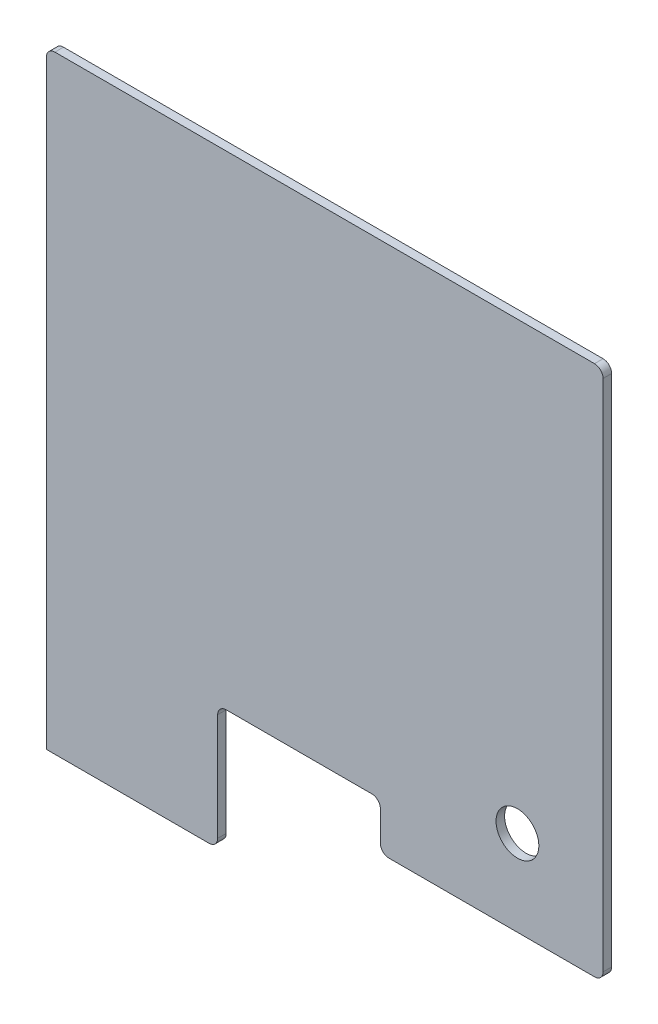
ISO-10303-21;
HEADER;
FILE_DESCRIPTION(('STEP AP214'),'2;1');
FILE_NAME('part.step','',(''),(''),'','','');
FILE_SCHEMA(('AUTOMOTIVE_DESIGN { 1 0 10303 214 1 1 1 1 }'));
ENDSEC;
DATA;
#1=APPLICATION_CONTEXT('core data for automotive mechanical design processes');
#2=APPLICATION_PROTOCOL_DEFINITION('international standard','automotive_design',2000,#1);
#3=PRODUCT_CONTEXT('',#1,'mechanical');
#4=PRODUCT('Part','Part','',(#3));
#5=PRODUCT_RELATED_PRODUCT_CATEGORY('part','',(#4));
#6=PRODUCT_DEFINITION_FORMATION('','',#4);
#7=PRODUCT_DEFINITION_CONTEXT('part definition',#1,'design');
#8=PRODUCT_DEFINITION('design','',#6,#7);
#9=PRODUCT_DEFINITION_SHAPE('','',#8);
#10=(LENGTH_UNIT() NAMED_UNIT(*) SI_UNIT(.MILLI.,.METRE.));
#11=(NAMED_UNIT(*) PLANE_ANGLE_UNIT() SI_UNIT($,.RADIAN.));
#12=(NAMED_UNIT(*) SI_UNIT($,.STERADIAN.) SOLID_ANGLE_UNIT());
#13=UNCERTAINTY_MEASURE_WITH_UNIT(LENGTH_MEASURE(1.E-05),#10,'distance_accuracy_value','');
#14=(GEOMETRIC_REPRESENTATION_CONTEXT(3) GLOBAL_UNCERTAINTY_ASSIGNED_CONTEXT((#13)) GLOBAL_UNIT_ASSIGNED_CONTEXT((#10,
#11,#12)) REPRESENTATION_CONTEXT('',''));
#15=CARTESIAN_POINT('',(0.,0.,0.));
#16=DIRECTION('',(0.,0.,1.));
#17=DIRECTION('',(1.,0.,0.));
#18=AXIS2_PLACEMENT_3D('',#15,#16,#17);
#19=CARTESIAN_POINT('',(0.,0.,6.35));
#20=DIRECTION('',(0.,0.,-1.));
#21=DIRECTION('',(-1.,0.,0.));
#22=AXIS2_PLACEMENT_3D('',#19,#20,#21);
#23=PLANE('',#22);
#24=DIRECTION('',(-1.,0.,0.));
#25=VECTOR('',#24,1.);
#26=CARTESIAN_POINT('',(-412.75,393.7,6.35));
#27=LINE('',#26,#25);
#28=CARTESIAN_POINT('',(-6.35000000000002,393.7,6.35));
#29=VERTEX_POINT('',#28);
#30=CARTESIAN_POINT('',(-406.4,393.7,6.35));
#31=VERTEX_POINT('',#30);
#32=EDGE_CURVE('E178',#29,#31,#27,.T.);
#33=ORIENTED_EDGE('',*,*,#32,.T.);
#34=CARTESIAN_POINT('',(-406.4,387.35,6.35));
#35=DIRECTION('',(0.,0.,-1.));
#36=DIRECTION('',(-1.,0.,0.));
#37=AXIS2_PLACEMENT_3D('',#34,#35,#36);
#38=CIRCLE('',#37,6.35);
#39=CARTESIAN_POINT('',(-412.75,387.35,6.35));
#40=VERTEX_POINT('',#39);
#41=EDGE_CURVE('E157',#31,#40,#38,.F.);
#42=ORIENTED_EDGE('',*,*,#41,.T.);
#43=DIRECTION('',(0.,-1.,0.));
#44=VECTOR('',#43,1.);
#45=CARTESIAN_POINT('',(-412.75,-57.15,6.35));
#46=LINE('',#45,#44);
#47=CARTESIAN_POINT('',(-412.75,-57.15,6.35));
#48=VERTEX_POINT('',#47);
#49=EDGE_CURVE('E150',#40,#48,#46,.T.);
#50=ORIENTED_EDGE('',*,*,#49,.T.);
#51=DIRECTION('',(1.,0.,0.));
#52=VECTOR('',#51,1.);
#53=CARTESIAN_POINT('',(-285.75,-57.15,6.35));
#54=LINE('',#53,#52);
#55=CARTESIAN_POINT('',(-292.1,-57.15,6.35));
#56=VERTEX_POINT('',#55);
#57=EDGE_CURVE('E154',#48,#56,#54,.T.);
#58=ORIENTED_EDGE('',*,*,#57,.T.);
#59=CARTESIAN_POINT('',(-292.1,-50.8,6.35));
#60=DIRECTION('',(0.,0.,-1.));
#61=DIRECTION('',(-1.,0.,0.));
#62=AXIS2_PLACEMENT_3D('',#59,#60,#61);
#63=CIRCLE('',#62,6.35);
#64=CARTESIAN_POINT('',(-285.75,-50.8,6.35));
#65=VERTEX_POINT('',#64);
#66=EDGE_CURVE('E201',#56,#65,#63,.F.);
#67=ORIENTED_EDGE('',*,*,#66,.T.);
#68=DIRECTION('',(0.,1.,0.));
#69=VECTOR('',#68,1.);
#70=CARTESIAN_POINT('',(-285.75,34.925,6.35));
#71=LINE('',#70,#69);
#72=CARTESIAN_POINT('',(-285.75,28.575,6.35));
#73=VERTEX_POINT('',#72);
#74=EDGE_CURVE('E171',#65,#73,#71,.T.);
#75=ORIENTED_EDGE('',*,*,#74,.T.);
#76=CARTESIAN_POINT('',(-279.4,28.575,6.35));
#77=DIRECTION('',(0.,0.,-1.));
#78=DIRECTION('',(-1.,0.,0.));
#79=AXIS2_PLACEMENT_3D('',#76,#77,#78);
#80=CIRCLE('',#79,6.35);
#81=CARTESIAN_POINT('',(-279.4,34.925,6.35));
#82=VERTEX_POINT('',#81);
#83=EDGE_CURVE('E11',#73,#82,#80,.T.);
#84=ORIENTED_EDGE('',*,*,#83,.T.);
#85=DIRECTION('',(1.,0.,0.));
#86=VECTOR('',#85,1.);
#87=CARTESIAN_POINT('',(-165.1,34.925,6.35));
#88=LINE('',#87,#86);
#89=CARTESIAN_POINT('',(-171.45,34.925,6.35));
#90=VERTEX_POINT('',#89);
#91=EDGE_CURVE('E260',#82,#90,#88,.T.);
#92=ORIENTED_EDGE('',*,*,#91,.T.);
#93=CARTESIAN_POINT('',(-171.45,28.575,6.35));
#94=DIRECTION('',(0.,0.,-1.));
#95=DIRECTION('',(-1.,0.,0.));
#96=AXIS2_PLACEMENT_3D('',#93,#94,#95);
#97=CIRCLE('',#96,6.35);
#98=CARTESIAN_POINT('',(-165.1,28.575,6.35));
#99=VERTEX_POINT('',#98);
#100=EDGE_CURVE('E236',#90,#99,#97,.T.);
#101=ORIENTED_EDGE('',*,*,#100,.T.);
#102=DIRECTION('',(0.,-1.,0.));
#103=VECTOR('',#102,1.);
#104=CARTESIAN_POINT('',(-165.1,0.,6.35));
#105=LINE('',#104,#103);
#106=CARTESIAN_POINT('',(-165.1,6.34999999999998,6.35));
#107=VERTEX_POINT('',#106);
#108=EDGE_CURVE('E265',#99,#107,#105,.T.);
#109=ORIENTED_EDGE('',*,*,#108,.T.);
#110=CARTESIAN_POINT('',(-158.75,6.34999999999998,6.35));
#111=DIRECTION('',(0.,0.,-1.));
#112=DIRECTION('',(-1.,0.,0.));
#113=AXIS2_PLACEMENT_3D('',#110,#111,#112);
#114=CIRCLE('',#113,6.35);
#115=CARTESIAN_POINT('',(-158.75,0.,6.35));
#116=VERTEX_POINT('',#115);
#117=EDGE_CURVE('E203',#107,#116,#114,.F.);
#118=ORIENTED_EDGE('',*,*,#117,.T.);
#119=DIRECTION('',(1.,0.,0.));
#120=VECTOR('',#119,1.);
#121=CARTESIAN_POINT('',(0.,0.,6.35));
#122=LINE('',#121,#120);
#123=CARTESIAN_POINT('',(-6.35,0.,6.35));
#124=VERTEX_POINT('',#123);
#125=EDGE_CURVE('E268',#116,#124,#122,.T.);
#126=ORIENTED_EDGE('',*,*,#125,.T.);
#127=CARTESIAN_POINT('',(-6.35,6.35000000000002,6.35));
#128=DIRECTION('',(0.,0.,-1.));
#129=DIRECTION('',(-1.,0.,0.));
#130=AXIS2_PLACEMENT_3D('',#127,#128,#129);
#131=CIRCLE('',#130,6.35);
#132=CARTESIAN_POINT('',(0.,6.35000000000002,6.35));
#133=VERTEX_POINT('',#132);
#134=EDGE_CURVE('E65',#124,#133,#131,.F.);
#135=ORIENTED_EDGE('',*,*,#134,.T.);
#136=DIRECTION('',(0.,1.,0.));
#137=VECTOR('',#136,1.);
#138=CARTESIAN_POINT('',(0.,393.7,6.35));
#139=LINE('',#138,#137);
#140=CARTESIAN_POINT('',(0.,387.35,6.35));
#141=VERTEX_POINT('',#140);
#142=EDGE_CURVE('E182',#133,#141,#139,.T.);
#143=ORIENTED_EDGE('',*,*,#142,.T.);
#144=CARTESIAN_POINT('',(-6.35000000000002,387.35,6.35));
#145=DIRECTION('',(0.,0.,-1.));
#146=DIRECTION('',(-1.,0.,0.));
#147=AXIS2_PLACEMENT_3D('',#144,#145,#146);
#148=CIRCLE('',#147,6.35);
#149=EDGE_CURVE('E206',#141,#29,#148,.F.);
#150=ORIENTED_EDGE('',*,*,#149,.T.);
#151=EDGE_LOOP('',(#33,#42,#50,#58,#67,#75,#84,#92,#101,#109,#118,#126,#135,#143,#150));
#152=FACE_BOUND('',#151,.T.);
#153=CARTESIAN_POINT('',(-63.5,63.5,6.35));
#154=DIRECTION('',(0.,0.,1.));
#155=DIRECTION('',(1.,0.,0.));
#156=AXIS2_PLACEMENT_3D('',#153,#154,#155);
#157=CIRCLE('',#156,15.875);
#158=CARTESIAN_POINT('',(-47.6249999999999,63.5,6.35));
#159=VERTEX_POINT('',#158);
#160=EDGE_CURVE('E275',#159,#159,#157,.T.);
#161=ORIENTED_EDGE('',*,*,#160,.F.);
#162=EDGE_LOOP('',(#161));
#163=FACE_BOUND('',#162,.T.);
#164=ADVANCED_FACE('F43',(#152,#163),#23,.F.);
#165=CARTESIAN_POINT('',(0.,0.,0.));
#166=DIRECTION('',(0.,0.,-1.));
#167=DIRECTION('',(-1.,0.,0.));
#168=AXIS2_PLACEMENT_3D('',#165,#166,#167);
#169=PLANE('',#168);
#170=DIRECTION('',(0.,-1.,0.));
#171=VECTOR('',#170,1.);
#172=CARTESIAN_POINT('',(-412.75,-57.15,0.));
#173=LINE('',#172,#171);
#174=CARTESIAN_POINT('',(-412.75,387.35,0.));
#175=VERTEX_POINT('',#174);
#176=CARTESIAN_POINT('',(-412.75,-57.15,0.));
#177=VERTEX_POINT('',#176);
#178=EDGE_CURVE('E175',#175,#177,#173,.T.);
#179=ORIENTED_EDGE('',*,*,#178,.F.);
#180=CARTESIAN_POINT('',(-406.4,387.35,0.));
#181=DIRECTION('',(0.,0.,-1.));
#182=DIRECTION('',(-1.,0.,0.));
#183=AXIS2_PLACEMENT_3D('',#180,#181,#182);
#184=CIRCLE('',#183,6.35);
#185=CARTESIAN_POINT('',(-406.4,393.7,0.));
#186=VERTEX_POINT('',#185);
#187=EDGE_CURVE('E194',#175,#186,#184,.T.);
#188=ORIENTED_EDGE('',*,*,#187,.T.);
#189=DIRECTION('',(-1.,0.,0.));
#190=VECTOR('',#189,1.);
#191=CARTESIAN_POINT('',(-412.75,393.7,0.));
#192=LINE('',#191,#190);
#193=CARTESIAN_POINT('',(-6.35000000000002,393.7,0.));
#194=VERTEX_POINT('',#193);
#195=EDGE_CURVE('E162',#194,#186,#192,.T.);
#196=ORIENTED_EDGE('',*,*,#195,.F.);
#197=CARTESIAN_POINT('',(-6.35000000000002,387.35,0.));
#198=DIRECTION('',(0.,0.,-1.));
#199=DIRECTION('',(-1.,0.,0.));
#200=AXIS2_PLACEMENT_3D('',#197,#198,#199);
#201=CIRCLE('',#200,6.35);
#202=CARTESIAN_POINT('',(0.,387.35,0.));
#203=VERTEX_POINT('',#202);
#204=EDGE_CURVE('E192',#194,#203,#201,.T.);
#205=ORIENTED_EDGE('',*,*,#204,.T.);
#206=DIRECTION('',(0.,1.,0.));
#207=VECTOR('',#206,1.);
#208=CARTESIAN_POINT('',(0.,393.7,0.));
#209=LINE('',#208,#207);
#210=CARTESIAN_POINT('',(0.,6.35000000000002,0.));
#211=VERTEX_POINT('',#210);
#212=EDGE_CURVE('E283',#211,#203,#209,.T.);
#213=ORIENTED_EDGE('',*,*,#212,.F.);
#214=CARTESIAN_POINT('',(-6.35,6.35000000000002,0.));
#215=DIRECTION('',(0.,0.,-1.));
#216=DIRECTION('',(-1.,0.,0.));
#217=AXIS2_PLACEMENT_3D('',#214,#215,#216);
#218=CIRCLE('',#217,6.35);
#219=CARTESIAN_POINT('',(-6.35,0.,0.));
#220=VERTEX_POINT('',#219);
#221=EDGE_CURVE('E190',#211,#220,#218,.T.);
#222=ORIENTED_EDGE('',*,*,#221,.T.);
#223=DIRECTION('',(1.,0.,0.));
#224=VECTOR('',#223,1.);
#225=CARTESIAN_POINT('',(0.,0.,0.));
#226=LINE('',#225,#224);
#227=CARTESIAN_POINT('',(-158.75,0.,0.));
#228=VERTEX_POINT('',#227);
#229=EDGE_CURVE('E281',#228,#220,#226,.T.);
#230=ORIENTED_EDGE('',*,*,#229,.F.);
#231=CARTESIAN_POINT('',(-158.75,6.34999999999998,0.));
#232=DIRECTION('',(0.,0.,-1.));
#233=DIRECTION('',(-1.,0.,0.));
#234=AXIS2_PLACEMENT_3D('',#231,#232,#233);
#235=CIRCLE('',#234,6.35);
#236=CARTESIAN_POINT('',(-165.1,6.34999999999998,0.));
#237=VERTEX_POINT('',#236);
#238=EDGE_CURVE('E188',#228,#237,#235,.T.);
#239=ORIENTED_EDGE('',*,*,#238,.T.);
#240=DIRECTION('',(0.,-1.,0.));
#241=VECTOR('',#240,1.);
#242=CARTESIAN_POINT('',(-165.1,0.,0.));
#243=LINE('',#242,#241);
#244=CARTESIAN_POINT('',(-165.1,28.575,0.));
#245=VERTEX_POINT('',#244);
#246=EDGE_CURVE('E278',#245,#237,#243,.T.);
#247=ORIENTED_EDGE('',*,*,#246,.F.);
#248=CARTESIAN_POINT('',(-171.45,28.575,0.));
#249=DIRECTION('',(0.,0.,-1.));
#250=DIRECTION('',(-1.,0.,0.));
#251=AXIS2_PLACEMENT_3D('',#248,#249,#250);
#252=CIRCLE('',#251,6.35);
#253=CARTESIAN_POINT('',(-171.45,34.925,0.));
#254=VERTEX_POINT('',#253);
#255=EDGE_CURVE('E234',#245,#254,#252,.F.);
#256=ORIENTED_EDGE('',*,*,#255,.T.);
#257=DIRECTION('',(1.,0.,0.));
#258=VECTOR('',#257,1.);
#259=CARTESIAN_POINT('',(-165.1,34.925,0.));
#260=LINE('',#259,#258);
#261=CARTESIAN_POINT('',(-279.4,34.925,0.));
#262=VERTEX_POINT('',#261);
#263=EDGE_CURVE('E245',#262,#254,#260,.T.);
#264=ORIENTED_EDGE('',*,*,#263,.F.);
#265=CARTESIAN_POINT('',(-279.4,28.575,0.));
#266=DIRECTION('',(0.,0.,-1.));
#267=DIRECTION('',(-1.,0.,0.));
#268=AXIS2_PLACEMENT_3D('',#265,#266,#267);
#269=CIRCLE('',#268,6.35);
#270=CARTESIAN_POINT('',(-285.75,28.575,0.));
#271=VERTEX_POINT('',#270);
#272=EDGE_CURVE('E51',#262,#271,#269,.F.);
#273=ORIENTED_EDGE('',*,*,#272,.T.);
#274=DIRECTION('',(0.,1.,0.));
#275=VECTOR('',#274,1.);
#276=CARTESIAN_POINT('',(-285.75,34.925,0.));
#277=LINE('',#276,#275);
#278=CARTESIAN_POINT('',(-285.75,-50.8,0.));
#279=VERTEX_POINT('',#278);
#280=EDGE_CURVE('E243',#279,#271,#277,.T.);
#281=ORIENTED_EDGE('',*,*,#280,.F.);
#282=CARTESIAN_POINT('',(-292.1,-50.8,0.));
#283=DIRECTION('',(0.,0.,-1.));
#284=DIRECTION('',(-1.,0.,0.));
#285=AXIS2_PLACEMENT_3D('',#282,#283,#284);
#286=CIRCLE('',#285,6.35);
#287=CARTESIAN_POINT('',(-292.1,-57.15,0.));
#288=VERTEX_POINT('',#287);
#289=EDGE_CURVE('E180',#279,#288,#286,.T.);
#290=ORIENTED_EDGE('',*,*,#289,.T.);
#291=DIRECTION('',(1.,0.,0.));
#292=VECTOR('',#291,1.);
#293=CARTESIAN_POINT('',(-285.75,-57.15,0.));
#294=LINE('',#293,#292);
#295=EDGE_CURVE('E254',#177,#288,#294,.T.);
#296=ORIENTED_EDGE('',*,*,#295,.F.);
#297=EDGE_LOOP('',(#179,#188,#196,#205,#213,#222,#230,#239,#247,#256,#264,#273,#281,#290,#296));
#298=FACE_BOUND('',#297,.T.);
#299=CARTESIAN_POINT('',(-63.5,63.5,0.));
#300=DIRECTION('',(0.,0.,1.));
#301=DIRECTION('',(1.,0.,0.));
#302=AXIS2_PLACEMENT_3D('',#299,#300,#301);
#303=CIRCLE('',#302,15.875);
#304=CARTESIAN_POINT('',(-47.6249999999999,63.5,0.));
#305=VERTEX_POINT('',#304);
#306=EDGE_CURVE('E468',#305,#305,#303,.T.);
#307=ORIENTED_EDGE('',*,*,#306,.T.);
#308=EDGE_LOOP('',(#307));
#309=FACE_BOUND('',#308,.T.);
#310=ADVANCED_FACE('F241',(#298,#309),#169,.T.);
#311=CARTESIAN_POINT('',(-412.75,-57.15,6.35));
#312=DIRECTION('',(1.,0.,0.));
#313=DIRECTION('',(0.,0.,-1.));
#314=AXIS2_PLACEMENT_3D('',#311,#312,#313);
#315=PLANE('',#314);
#316=ORIENTED_EDGE('',*,*,#49,.F.);
#317=DIRECTION('',(0.,0.,-1.));
#318=VECTOR('',#317,1.);
#319=CARTESIAN_POINT('',(-412.75,387.35,6.35));
#320=LINE('',#319,#318);
#321=EDGE_CURVE('E177',#40,#175,#320,.T.);
#322=ORIENTED_EDGE('',*,*,#321,.T.);
#323=ORIENTED_EDGE('',*,*,#178,.T.);
#324=DIRECTION('',(0.,0.,-1.));
#325=VECTOR('',#324,1.);
#326=CARTESIAN_POINT('',(-412.75,-57.15,6.35));
#327=LINE('',#326,#325);
#328=EDGE_CURVE('E168',#48,#177,#327,.T.);
#329=ORIENTED_EDGE('',*,*,#328,.F.);
#330=EDGE_LOOP('',(#316,#322,#323,#329));
#331=FACE_BOUND('',#330,.T.);
#332=ADVANCED_FACE('F173',(#331),#315,.F.);
#333=CARTESIAN_POINT('',(-285.75,-57.15,6.35));
#334=DIRECTION('',(0.,1.,0.));
#335=DIRECTION('',(-1.,0.,0.));
#336=AXIS2_PLACEMENT_3D('',#333,#334,#335);
#337=PLANE('',#336);
#338=ORIENTED_EDGE('',*,*,#295,.T.);
#339=DIRECTION('',(0.,0.,-1.));
#340=VECTOR('',#339,1.);
#341=CARTESIAN_POINT('',(-292.1,-57.15,6.35));
#342=LINE('',#341,#340);
#343=EDGE_CURVE('E170',#288,#56,#342,.F.);
#344=ORIENTED_EDGE('',*,*,#343,.T.);
#345=ORIENTED_EDGE('',*,*,#57,.F.);
#346=ORIENTED_EDGE('',*,*,#328,.T.);
#347=EDGE_LOOP('',(#338,#344,#345,#346));
#348=FACE_BOUND('',#347,.T.);
#349=ADVANCED_FACE('F167',(#348),#337,.F.);
#350=CARTESIAN_POINT('',(-285.75,34.925,6.35));
#351=DIRECTION('',(-1.,0.,0.));
#352=DIRECTION('',(0.,0.,1.));
#353=AXIS2_PLACEMENT_3D('',#350,#351,#352);
#354=PLANE('',#353);
#355=ORIENTED_EDGE('',*,*,#280,.T.);
#356=DIRECTION('',(0.,0.,-1.));
#357=VECTOR('',#356,1.);
#358=CARTESIAN_POINT('',(-285.75,28.575,6.35));
#359=LINE('',#358,#357);
#360=EDGE_CURVE('E231',#271,#73,#359,.F.);
#361=ORIENTED_EDGE('',*,*,#360,.T.);
#362=ORIENTED_EDGE('',*,*,#74,.F.);
#363=DIRECTION('',(0.,0.,-1.));
#364=VECTOR('',#363,1.);
#365=CARTESIAN_POINT('',(-285.75,-50.8,6.35));
#366=LINE('',#365,#364);
#367=EDGE_CURVE('E228',#65,#279,#366,.T.);
#368=ORIENTED_EDGE('',*,*,#367,.T.);
#369=EDGE_LOOP('',(#355,#361,#362,#368));
#370=FACE_BOUND('',#369,.T.);
#371=ADVANCED_FACE('F250',(#370),#354,.F.);
#372=CARTESIAN_POINT('',(-165.1,34.925,6.35));
#373=DIRECTION('',(0.,1.,0.));
#374=DIRECTION('',(-1.,0.,0.));
#375=AXIS2_PLACEMENT_3D('',#372,#373,#374);
#376=PLANE('',#375);
#377=ORIENTED_EDGE('',*,*,#263,.T.);
#378=DIRECTION('',(0.,0.,-1.));
#379=VECTOR('',#378,1.);
#380=CARTESIAN_POINT('',(-171.45,34.925,6.35));
#381=LINE('',#380,#379);
#382=EDGE_CURVE('E226',#254,#90,#381,.F.);
#383=ORIENTED_EDGE('',*,*,#382,.T.);
#384=ORIENTED_EDGE('',*,*,#91,.F.);
#385=DIRECTION('',(0.,0.,-1.));
#386=VECTOR('',#385,1.);
#387=CARTESIAN_POINT('',(-279.4,34.925,0.));
#388=LINE('',#387,#386);
#389=EDGE_CURVE('E223',#82,#262,#388,.T.);
#390=ORIENTED_EDGE('',*,*,#389,.T.);
#391=EDGE_LOOP('',(#377,#383,#384,#390));
#392=FACE_BOUND('',#391,.T.);
#393=ADVANCED_FACE('F263',(#392),#376,.F.);
#394=CARTESIAN_POINT('',(-165.1,0.,6.35));
#395=DIRECTION('',(1.,0.,0.));
#396=DIRECTION('',(0.,0.,-1.));
#397=AXIS2_PLACEMENT_3D('',#394,#395,#396);
#398=PLANE('',#397);
#399=ORIENTED_EDGE('',*,*,#246,.T.);
#400=DIRECTION('',(0.,0.,-1.));
#401=VECTOR('',#400,1.);
#402=CARTESIAN_POINT('',(-165.1,6.34999999999998,6.35));
#403=LINE('',#402,#401);
#404=EDGE_CURVE('E221',#237,#107,#403,.F.);
#405=ORIENTED_EDGE('',*,*,#404,.T.);
#406=ORIENTED_EDGE('',*,*,#108,.F.);
#407=DIRECTION('',(0.,0.,-1.));
#408=VECTOR('',#407,1.);
#409=CARTESIAN_POINT('',(-165.1,28.575,0.));
#410=LINE('',#409,#408);
#411=EDGE_CURVE('E218',#99,#245,#410,.T.);
#412=ORIENTED_EDGE('',*,*,#411,.T.);
#413=EDGE_LOOP('',(#399,#405,#406,#412));
#414=FACE_BOUND('',#413,.T.);
#415=ADVANCED_FACE('F318',(#414),#398,.F.);
#416=CARTESIAN_POINT('',(0.,0.,6.35));
#417=DIRECTION('',(0.,1.,0.));
#418=DIRECTION('',(-1.,0.,0.));
#419=AXIS2_PLACEMENT_3D('',#416,#417,#418);
#420=PLANE('',#419);
#421=ORIENTED_EDGE('',*,*,#229,.T.);
#422=DIRECTION('',(0.,0.,-1.));
#423=VECTOR('',#422,1.);
#424=CARTESIAN_POINT('',(-6.35,0.,6.35));
#425=LINE('',#424,#423);
#426=EDGE_CURVE('E216',#220,#124,#425,.F.);
#427=ORIENTED_EDGE('',*,*,#426,.T.);
#428=ORIENTED_EDGE('',*,*,#125,.F.);
#429=DIRECTION('',(0.,0.,-1.));
#430=VECTOR('',#429,1.);
#431=CARTESIAN_POINT('',(-158.75,0.,6.35));
#432=LINE('',#431,#430);
#433=EDGE_CURVE('E213',#116,#228,#432,.T.);
#434=ORIENTED_EDGE('',*,*,#433,.T.);
#435=EDGE_LOOP('',(#421,#427,#428,#434));
#436=FACE_BOUND('',#435,.T.);
#437=ADVANCED_FACE('F315',(#436),#420,.F.);
#438=CARTESIAN_POINT('',(0.,393.7,6.35));
#439=DIRECTION('',(-1.,0.,0.));
#440=DIRECTION('',(0.,0.,1.));
#441=AXIS2_PLACEMENT_3D('',#438,#439,#440);
#442=PLANE('',#441);
#443=ORIENTED_EDGE('',*,*,#212,.T.);
#444=DIRECTION('',(0.,0.,-1.));
#445=VECTOR('',#444,1.);
#446=CARTESIAN_POINT('',(0.,387.35,6.35));
#447=LINE('',#446,#445);
#448=EDGE_CURVE('E58',#203,#141,#447,.F.);
#449=ORIENTED_EDGE('',*,*,#448,.T.);
#450=ORIENTED_EDGE('',*,*,#142,.F.);
#451=DIRECTION('',(0.,0.,-1.));
#452=VECTOR('',#451,1.);
#453=CARTESIAN_POINT('',(0.,6.35000000000002,6.35));
#454=LINE('',#453,#452);
#455=EDGE_CURVE('E209',#133,#211,#454,.T.);
#456=ORIENTED_EDGE('',*,*,#455,.T.);
#457=EDGE_LOOP('',(#443,#449,#450,#456));
#458=FACE_BOUND('',#457,.T.);
#459=ADVANCED_FACE('F312',(#458),#442,.F.);
#460=CARTESIAN_POINT('',(-412.75,393.7,6.35));
#461=DIRECTION('',(0.,-1.,0.));
#462=DIRECTION('',(0.,0.,-1.));
#463=AXIS2_PLACEMENT_3D('',#460,#461,#462);
#464=PLANE('',#463);
#465=ORIENTED_EDGE('',*,*,#195,.T.);
#466=DIRECTION('',(0.,0.,-1.));
#467=VECTOR('',#466,1.);
#468=CARTESIAN_POINT('',(-406.4,393.7,6.35));
#469=LINE('',#468,#467);
#470=EDGE_CURVE('E199',#186,#31,#469,.F.);
#471=ORIENTED_EDGE('',*,*,#470,.T.);
#472=ORIENTED_EDGE('',*,*,#32,.F.);
#473=DIRECTION('',(0.,0.,-1.));
#474=VECTOR('',#473,1.);
#475=CARTESIAN_POINT('',(-6.35000000000002,393.7,6.35));
#476=LINE('',#475,#474);
#477=EDGE_CURVE('E196',#29,#194,#476,.T.);
#478=ORIENTED_EDGE('',*,*,#477,.T.);
#479=EDGE_LOOP('',(#465,#471,#472,#478));
#480=FACE_BOUND('',#479,.T.);
#481=ADVANCED_FACE('F289',(#480),#464,.F.);
#482=CARTESIAN_POINT('',(-63.5,63.5,6.35));
#483=DIRECTION('',(0.,0.,-1.));
#484=DIRECTION('',(-1.,0.,0.));
#485=AXIS2_PLACEMENT_3D('',#482,#483,#484);
#486=CYLINDRICAL_SURFACE('',#485,15.875);
#487=ORIENTED_EDGE('',*,*,#160,.T.);
#488=EDGE_LOOP('',(#487));
#489=FACE_BOUND('',#488,.T.);
#490=ORIENTED_EDGE('',*,*,#306,.F.);
#491=EDGE_LOOP('',(#490));
#492=FACE_BOUND('',#491,.T.);
#493=ADVANCED_FACE('F308',(#489,#492),#486,.F.);
#494=CARTESIAN_POINT('',(-406.4,387.35,6.35));
#495=DIRECTION('',(0.,0.,-1.));
#496=DIRECTION('',(-1.,0.,0.));
#497=AXIS2_PLACEMENT_3D('',#494,#495,#496);
#498=CYLINDRICAL_SURFACE('',#497,6.35);
#499=ORIENTED_EDGE('',*,*,#41,.F.);
#500=ORIENTED_EDGE('',*,*,#470,.F.);
#501=ORIENTED_EDGE('',*,*,#187,.F.);
#502=ORIENTED_EDGE('',*,*,#321,.F.);
#503=EDGE_LOOP('',(#499,#500,#501,#502));
#504=FACE_BOUND('',#503,.T.);
#505=ADVANCED_FACE('F293',(#504),#498,.T.);
#506=CARTESIAN_POINT('',(-6.35000000000002,387.35,6.35));
#507=DIRECTION('',(0.,0.,-1.));
#508=DIRECTION('',(-1.,0.,0.));
#509=AXIS2_PLACEMENT_3D('',#506,#507,#508);
#510=CYLINDRICAL_SURFACE('',#509,6.35);
#511=ORIENTED_EDGE('',*,*,#149,.F.);
#512=ORIENTED_EDGE('',*,*,#448,.F.);
#513=ORIENTED_EDGE('',*,*,#204,.F.);
#514=ORIENTED_EDGE('',*,*,#477,.F.);
#515=EDGE_LOOP('',(#511,#512,#513,#514));
#516=FACE_BOUND('',#515,.T.);
#517=ADVANCED_FACE('F333',(#516),#510,.T.);
#518=CARTESIAN_POINT('',(-6.35,6.35000000000002,6.35));
#519=DIRECTION('',(0.,0.,-1.));
#520=DIRECTION('',(-1.,0.,0.));
#521=AXIS2_PLACEMENT_3D('',#518,#519,#520);
#522=CYLINDRICAL_SURFACE('',#521,6.35);
#523=ORIENTED_EDGE('',*,*,#134,.F.);
#524=ORIENTED_EDGE('',*,*,#426,.F.);
#525=ORIENTED_EDGE('',*,*,#221,.F.);
#526=ORIENTED_EDGE('',*,*,#455,.F.);
#527=EDGE_LOOP('',(#523,#524,#525,#526));
#528=FACE_BOUND('',#527,.T.);
#529=ADVANCED_FACE('F336',(#528),#522,.T.);
#530=CARTESIAN_POINT('',(-158.75,6.34999999999998,6.35));
#531=DIRECTION('',(0.,0.,-1.));
#532=DIRECTION('',(-1.,0.,0.));
#533=AXIS2_PLACEMENT_3D('',#530,#531,#532);
#534=CYLINDRICAL_SURFACE('',#533,6.35);
#535=ORIENTED_EDGE('',*,*,#117,.F.);
#536=ORIENTED_EDGE('',*,*,#404,.F.);
#537=ORIENTED_EDGE('',*,*,#238,.F.);
#538=ORIENTED_EDGE('',*,*,#433,.F.);
#539=EDGE_LOOP('',(#535,#536,#537,#538));
#540=FACE_BOUND('',#539,.T.);
#541=ADVANCED_FACE('F340',(#540),#534,.T.);
#542=CARTESIAN_POINT('',(-171.45,28.575,6.35));
#543=DIRECTION('',(0.,0.,1.));
#544=DIRECTION('',(1.,0.,0.));
#545=AXIS2_PLACEMENT_3D('',#542,#543,#544);
#546=CYLINDRICAL_SURFACE('',#545,6.35);
#547=ORIENTED_EDGE('',*,*,#100,.F.);
#548=ORIENTED_EDGE('',*,*,#382,.F.);
#549=ORIENTED_EDGE('',*,*,#255,.F.);
#550=ORIENTED_EDGE('',*,*,#411,.F.);
#551=EDGE_LOOP('',(#547,#548,#549,#550));
#552=FACE_BOUND('',#551,.T.);
#553=ADVANCED_FACE('F299',(#552),#546,.F.);
#554=CARTESIAN_POINT('',(-279.4,28.575,6.35));
#555=DIRECTION('',(0.,0.,1.));
#556=DIRECTION('',(1.,0.,0.));
#557=AXIS2_PLACEMENT_3D('',#554,#555,#556);
#558=CYLINDRICAL_SURFACE('',#557,6.35);
#559=ORIENTED_EDGE('',*,*,#83,.F.);
#560=ORIENTED_EDGE('',*,*,#360,.F.);
#561=ORIENTED_EDGE('',*,*,#272,.F.);
#562=ORIENTED_EDGE('',*,*,#389,.F.);
#563=EDGE_LOOP('',(#559,#560,#561,#562));
#564=FACE_BOUND('',#563,.T.);
#565=ADVANCED_FACE('F257',(#564),#558,.F.);
#566=CARTESIAN_POINT('',(-292.1,-50.8,6.35));
#567=DIRECTION('',(0.,0.,-1.));
#568=DIRECTION('',(-1.,0.,0.));
#569=AXIS2_PLACEMENT_3D('',#566,#567,#568);
#570=CYLINDRICAL_SURFACE('',#569,6.35);
#571=ORIENTED_EDGE('',*,*,#66,.F.);
#572=ORIENTED_EDGE('',*,*,#343,.F.);
#573=ORIENTED_EDGE('',*,*,#289,.F.);
#574=ORIENTED_EDGE('',*,*,#367,.F.);
#575=EDGE_LOOP('',(#571,#572,#573,#574));
#576=FACE_BOUND('',#575,.T.);
#577=ADVANCED_FACE('F45',(#576),#570,.T.);
#578=CLOSED_SHELL('',(#164,#310,#332,#349,#371,#393,#415,#437,#459,#481,#493,#505,#517,#529,
#541,#553,#565,#577));
#579=MANIFOLD_SOLID_BREP('B2',#578);
#580=ADVANCED_BREP_SHAPE_REPRESENTATION('',(#18,#579),#14);
#581=SHAPE_DEFINITION_REPRESENTATION(#9,#580);
ENDSEC;
END-ISO-10303-21;
